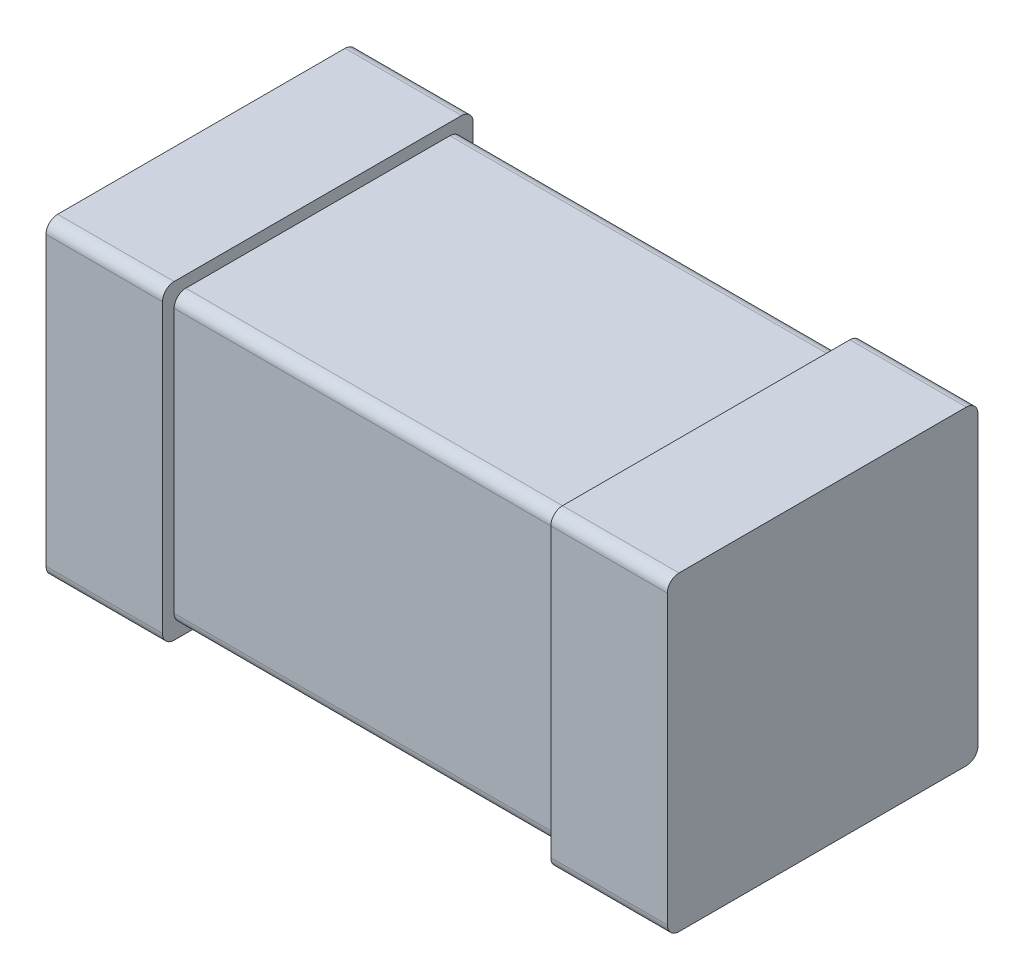
ISO-10303-21;
HEADER;
FILE_DESCRIPTION(('STEP AP214'),'2;1');
FILE_NAME('part.step','',(''),(''),'','','');
FILE_SCHEMA(('AUTOMOTIVE_DESIGN { 1 0 10303 214 1 1 1 1 }'));
ENDSEC;
DATA;
#1=APPLICATION_CONTEXT('core data for automotive mechanical design processes');
#2=APPLICATION_PROTOCOL_DEFINITION('international standard','automotive_design',2000,#1);
#3=PRODUCT_CONTEXT('',#1,'mechanical');
#4=PRODUCT('Part','Part','',(#3));
#5=PRODUCT_RELATED_PRODUCT_CATEGORY('part','',(#4));
#6=PRODUCT_DEFINITION_FORMATION('','',#4);
#7=PRODUCT_DEFINITION_CONTEXT('part definition',#1,'design');
#8=PRODUCT_DEFINITION('design','',#6,#7);
#9=PRODUCT_DEFINITION_SHAPE('','',#8);
#10=(LENGTH_UNIT() NAMED_UNIT(*) SI_UNIT(.MILLI.,.METRE.));
#11=(NAMED_UNIT(*) PLANE_ANGLE_UNIT() SI_UNIT($,.RADIAN.));
#12=(NAMED_UNIT(*) SI_UNIT($,.STERADIAN.) SOLID_ANGLE_UNIT());
#13=UNCERTAINTY_MEASURE_WITH_UNIT(LENGTH_MEASURE(1.E-05),#10,'distance_accuracy_value','');
#14=(GEOMETRIC_REPRESENTATION_CONTEXT(3) GLOBAL_UNCERTAINTY_ASSIGNED_CONTEXT((#13)) GLOBAL_UNIT_ASSIGNED_CONTEXT((#10,
#11,#12)) REPRESENTATION_CONTEXT('',''));
#15=CARTESIAN_POINT('',(0.,0.,0.));
#16=DIRECTION('',(0.,0.,1.));
#17=DIRECTION('',(1.,0.,0.));
#18=AXIS2_PLACEMENT_3D('',#15,#16,#17);
#19=CARTESIAN_POINT('',(0.8,-0.4,0.));
#20=DIRECTION('',(1.,0.,0.));
#21=DIRECTION('',(0.,1.,0.));
#22=AXIS2_PLACEMENT_3D('',#19,#20,#21);
#23=PLANE('',#22);
#24=DIRECTION('',(0.,0.,1.));
#25=VECTOR('',#24,1.);
#26=CARTESIAN_POINT('',(0.8,-0.4,0.));
#27=LINE('',#26,#25);
#28=CARTESIAN_POINT('',(0.8,-0.4,0.03));
#29=VERTEX_POINT('',#28);
#30=CARTESIAN_POINT('',(0.8,-0.4,0.77));
#31=VERTEX_POINT('',#30);
#32=EDGE_CURVE('E230',#29,#31,#27,.T.);
#33=ORIENTED_EDGE('',*,*,#32,.F.);
#34=CARTESIAN_POINT('',(0.8,-0.37,0.03));
#35=DIRECTION('',(1.,0.,0.));
#36=DIRECTION('',(0.,0.,1.));
#37=AXIS2_PLACEMENT_3D('',#34,#35,#36);
#38=CIRCLE('',#37,0.03);
#39=CARTESIAN_POINT('',(0.8,-0.37,0.));
#40=VERTEX_POINT('',#39);
#41=EDGE_CURVE('E186',#29,#40,#38,.T.);
#42=ORIENTED_EDGE('',*,*,#41,.T.);
#43=DIRECTION('',(0.,1.,0.));
#44=VECTOR('',#43,1.);
#45=CARTESIAN_POINT('',(0.8,-0.4,0.));
#46=LINE('',#45,#44);
#47=CARTESIAN_POINT('',(0.8,0.37,0.));
#48=VERTEX_POINT('',#47);
#49=EDGE_CURVE('E184',#40,#48,#46,.T.);
#50=ORIENTED_EDGE('',*,*,#49,.T.);
#51=CARTESIAN_POINT('',(0.8,0.37,0.03));
#52=DIRECTION('',(-1.,0.,0.));
#53=DIRECTION('',(0.,0.,1.));
#54=AXIS2_PLACEMENT_3D('',#51,#52,#53);
#55=CIRCLE('',#54,0.03);
#56=CARTESIAN_POINT('',(0.8,0.4,0.03));
#57=VERTEX_POINT('',#56);
#58=EDGE_CURVE('E172',#57,#48,#55,.T.);
#59=ORIENTED_EDGE('',*,*,#58,.F.);
#60=DIRECTION('',(0.,0.,1.));
#61=VECTOR('',#60,1.);
#62=CARTESIAN_POINT('',(0.8,0.4,0.));
#63=LINE('',#62,#61);
#64=CARTESIAN_POINT('',(0.8,0.4,0.77));
#65=VERTEX_POINT('',#64);
#66=EDGE_CURVE('E11',#57,#65,#63,.T.);
#67=ORIENTED_EDGE('',*,*,#66,.T.);
#68=CARTESIAN_POINT('',(0.8,0.37,0.77));
#69=DIRECTION('',(1.,0.,0.));
#70=DIRECTION('',(0.,0.,1.));
#71=AXIS2_PLACEMENT_3D('',#68,#69,#70);
#72=CIRCLE('',#71,0.03);
#73=CARTESIAN_POINT('',(0.8,0.37,0.8));
#74=VERTEX_POINT('',#73);
#75=EDGE_CURVE('E181',#65,#74,#72,.T.);
#76=ORIENTED_EDGE('',*,*,#75,.T.);
#77=DIRECTION('',(0.,1.,0.));
#78=VECTOR('',#77,1.);
#79=CARTESIAN_POINT('',(0.8,-0.4,0.8));
#80=LINE('',#79,#78);
#81=CARTESIAN_POINT('',(0.8,-0.37,0.8));
#82=VERTEX_POINT('',#81);
#83=EDGE_CURVE('E190',#82,#74,#80,.T.);
#84=ORIENTED_EDGE('',*,*,#83,.F.);
#85=CARTESIAN_POINT('',(0.8,-0.37,0.77));
#86=DIRECTION('',(-1.,0.,0.));
#87=DIRECTION('',(0.,0.,1.));
#88=AXIS2_PLACEMENT_3D('',#85,#86,#87);
#89=CIRCLE('',#88,0.03);
#90=EDGE_CURVE('E203',#31,#82,#89,.T.);
#91=ORIENTED_EDGE('',*,*,#90,.F.);
#92=EDGE_LOOP('',(#33,#42,#50,#59,#67,#76,#84,#91));
#93=FACE_BOUND('',#92,.T.);
#94=ADVANCED_FACE('F17',(#93),#23,.T.);
#95=CARTESIAN_POINT('',(0.5,0.4,0.));
#96=DIRECTION('',(0.,1.,0.));
#97=DIRECTION('',(1.,0.,0.));
#98=AXIS2_PLACEMENT_3D('',#95,#96,#97);
#99=PLANE('',#98);
#100=ORIENTED_EDGE('',*,*,#66,.F.);
#101=DIRECTION('',(1.,0.,0.));
#102=VECTOR('',#101,1.);
#103=CARTESIAN_POINT('',(0.5,0.4,0.03));
#104=LINE('',#103,#102);
#105=CARTESIAN_POINT('',(0.5,0.4,0.03));
#106=VERTEX_POINT('',#105);
#107=EDGE_CURVE('E179',#106,#57,#104,.T.);
#108=ORIENTED_EDGE('',*,*,#107,.F.);
#109=DIRECTION('',(0.,0.,1.));
#110=VECTOR('',#109,1.);
#111=CARTESIAN_POINT('',(0.5,0.4,0.));
#112=LINE('',#111,#110);
#113=CARTESIAN_POINT('',(0.5,0.4,0.77));
#114=VERTEX_POINT('',#113);
#115=EDGE_CURVE('E257',#106,#114,#112,.T.);
#116=ORIENTED_EDGE('',*,*,#115,.T.);
#117=DIRECTION('',(1.,0.,0.));
#118=VECTOR('',#117,1.);
#119=CARTESIAN_POINT('',(0.5,0.4,0.77));
#120=LINE('',#119,#118);
#121=EDGE_CURVE('E26',#114,#65,#120,.T.);
#122=ORIENTED_EDGE('',*,*,#121,.T.);
#123=EDGE_LOOP('',(#100,#108,#116,#122));
#124=FACE_BOUND('',#123,.T.);
#125=ADVANCED_FACE('F559',(#124),#99,.T.);
#126=CARTESIAN_POINT('',(0.5,0.37,0.77));
#127=DIRECTION('',(1.,0.,0.));
#128=DIRECTION('',(0.,1.,0.));
#129=AXIS2_PLACEMENT_3D('',#126,#127,#128);
#130=CYLINDRICAL_SURFACE('',#129,0.03);
#131=CARTESIAN_POINT('',(0.5,0.37,0.77));
#132=DIRECTION('',(1.,0.,0.));
#133=DIRECTION('',(0.,0.,1.));
#134=AXIS2_PLACEMENT_3D('',#131,#132,#133);
#135=CIRCLE('',#134,0.03);
#136=CARTESIAN_POINT('',(0.5,0.37,0.8));
#137=VERTEX_POINT('',#136);
#138=EDGE_CURVE('E258',#114,#137,#135,.T.);
#139=ORIENTED_EDGE('',*,*,#138,.T.);
#140=DIRECTION('',(1.,0.,0.));
#141=VECTOR('',#140,1.);
#142=CARTESIAN_POINT('',(0.5,0.37,0.8));
#143=LINE('',#142,#141);
#144=EDGE_CURVE('E206',#137,#74,#143,.T.);
#145=ORIENTED_EDGE('',*,*,#144,.T.);
#146=ORIENTED_EDGE('',*,*,#75,.F.);
#147=ORIENTED_EDGE('',*,*,#121,.F.);
#148=EDGE_LOOP('',(#139,#145,#146,#147));
#149=FACE_BOUND('',#148,.T.);
#150=ADVANCED_FACE('F19',(#149),#130,.T.);
#151=CARTESIAN_POINT('',(0.5,0.37,0.03));
#152=DIRECTION('',(1.,0.,0.));
#153=DIRECTION('',(0.,1.,0.));
#154=AXIS2_PLACEMENT_3D('',#151,#152,#153);
#155=CYLINDRICAL_SURFACE('',#154,0.03);
#156=ORIENTED_EDGE('',*,*,#107,.T.);
#157=ORIENTED_EDGE('',*,*,#58,.T.);
#158=DIRECTION('',(1.,0.,0.));
#159=VECTOR('',#158,1.);
#160=CARTESIAN_POINT('',(0.5,0.37,0.));
#161=LINE('',#160,#159);
#162=CARTESIAN_POINT('',(0.5,0.37,0.));
#163=VERTEX_POINT('',#162);
#164=EDGE_CURVE('E177',#163,#48,#161,.T.);
#165=ORIENTED_EDGE('',*,*,#164,.F.);
#166=CARTESIAN_POINT('',(0.5,0.37,0.03));
#167=DIRECTION('',(-1.,0.,0.));
#168=DIRECTION('',(0.,0.,1.));
#169=AXIS2_PLACEMENT_3D('',#166,#167,#168);
#170=CIRCLE('',#169,0.03);
#171=EDGE_CURVE('E254',#106,#163,#170,.T.);
#172=ORIENTED_EDGE('',*,*,#171,.F.);
#173=EDGE_LOOP('',(#156,#157,#165,#172));
#174=FACE_BOUND('',#173,.T.);
#175=ADVANCED_FACE('F174',(#174),#155,.T.);
#176=CARTESIAN_POINT('',(0.5,-0.4,0.8));
#177=DIRECTION('',(0.,0.,1.));
#178=DIRECTION('',(1.,0.,0.));
#179=AXIS2_PLACEMENT_3D('',#176,#177,#178);
#180=PLANE('',#179);
#181=DIRECTION('',(0.,1.,0.));
#182=VECTOR('',#181,1.);
#183=CARTESIAN_POINT('',(0.5,-0.4,0.8));
#184=LINE('',#183,#182);
#185=CARTESIAN_POINT('',(0.5,-0.37,0.8));
#186=VERTEX_POINT('',#185);
#187=EDGE_CURVE('E262',#186,#137,#184,.T.);
#188=ORIENTED_EDGE('',*,*,#187,.F.);
#189=DIRECTION('',(1.,0.,0.));
#190=VECTOR('',#189,1.);
#191=CARTESIAN_POINT('',(0.5,-0.37,0.8));
#192=LINE('',#191,#190);
#193=EDGE_CURVE('E197',#186,#82,#192,.T.);
#194=ORIENTED_EDGE('',*,*,#193,.T.);
#195=ORIENTED_EDGE('',*,*,#83,.T.);
#196=ORIENTED_EDGE('',*,*,#144,.F.);
#197=EDGE_LOOP('',(#188,#194,#195,#196));
#198=FACE_BOUND('',#197,.T.);
#199=ADVANCED_FACE('F571',(#198),#180,.T.);
#200=CARTESIAN_POINT('',(0.5,-0.4,0.));
#201=DIRECTION('',(0.,0.,1.));
#202=DIRECTION('',(1.,0.,0.));
#203=AXIS2_PLACEMENT_3D('',#200,#201,#202);
#204=PLANE('',#203);
#205=ORIENTED_EDGE('',*,*,#164,.T.);
#206=ORIENTED_EDGE('',*,*,#49,.F.);
#207=DIRECTION('',(1.,0.,0.));
#208=VECTOR('',#207,1.);
#209=CARTESIAN_POINT('',(0.5,-0.37,0.));
#210=LINE('',#209,#208);
#211=CARTESIAN_POINT('',(0.5,-0.37,0.));
#212=VERTEX_POINT('',#211);
#213=EDGE_CURVE('E224',#212,#40,#210,.T.);
#214=ORIENTED_EDGE('',*,*,#213,.F.);
#215=DIRECTION('',(0.,1.,0.));
#216=VECTOR('',#215,1.);
#217=CARTESIAN_POINT('',(0.5,-0.4,0.));
#218=LINE('',#217,#216);
#219=EDGE_CURVE('E194',#212,#163,#218,.T.);
#220=ORIENTED_EDGE('',*,*,#219,.T.);
#221=EDGE_LOOP('',(#205,#206,#214,#220));
#222=FACE_BOUND('',#221,.T.);
#223=ADVANCED_FACE('F192',(#222),#204,.F.);
#224=CARTESIAN_POINT('',(0.5,-0.37,0.77));
#225=DIRECTION('',(1.,0.,0.));
#226=DIRECTION('',(0.,-1.,0.));
#227=AXIS2_PLACEMENT_3D('',#224,#225,#226);
#228=CYLINDRICAL_SURFACE('',#227,0.03);
#229=DIRECTION('',(1.,0.,0.));
#230=VECTOR('',#229,1.);
#231=CARTESIAN_POINT('',(0.5,-0.4,0.77));
#232=LINE('',#231,#230);
#233=CARTESIAN_POINT('',(0.5,-0.4,0.77));
#234=VERTEX_POINT('',#233);
#235=EDGE_CURVE('E244',#234,#31,#232,.T.);
#236=ORIENTED_EDGE('',*,*,#235,.T.);
#237=ORIENTED_EDGE('',*,*,#90,.T.);
#238=ORIENTED_EDGE('',*,*,#193,.F.);
#239=CARTESIAN_POINT('',(0.5,-0.37,0.77));
#240=DIRECTION('',(-1.,0.,0.));
#241=DIRECTION('',(0.,0.,1.));
#242=AXIS2_PLACEMENT_3D('',#239,#240,#241);
#243=CIRCLE('',#242,0.03);
#244=EDGE_CURVE('E266',#234,#186,#243,.T.);
#245=ORIENTED_EDGE('',*,*,#244,.F.);
#246=EDGE_LOOP('',(#236,#237,#238,#245));
#247=FACE_BOUND('',#246,.T.);
#248=ADVANCED_FACE('F567',(#247),#228,.T.);
#249=CARTESIAN_POINT('',(0.5,-0.37,0.03));
#250=DIRECTION('',(1.,0.,0.));
#251=DIRECTION('',(0.,-1.,0.));
#252=AXIS2_PLACEMENT_3D('',#249,#250,#251);
#253=CYLINDRICAL_SURFACE('',#252,0.03);
#254=CARTESIAN_POINT('',(0.5,-0.37,0.03));
#255=DIRECTION('',(1.,0.,0.));
#256=DIRECTION('',(0.,0.,1.));
#257=AXIS2_PLACEMENT_3D('',#254,#255,#256);
#258=CIRCLE('',#257,0.03);
#259=CARTESIAN_POINT('',(0.5,-0.4,0.03));
#260=VERTEX_POINT('',#259);
#261=EDGE_CURVE('E249',#260,#212,#258,.T.);
#262=ORIENTED_EDGE('',*,*,#261,.T.);
#263=ORIENTED_EDGE('',*,*,#213,.T.);
#264=ORIENTED_EDGE('',*,*,#41,.F.);
#265=DIRECTION('',(1.,0.,0.));
#266=VECTOR('',#265,1.);
#267=CARTESIAN_POINT('',(0.5,-0.4,0.03));
#268=LINE('',#267,#266);
#269=EDGE_CURVE('E237',#260,#29,#268,.T.);
#270=ORIENTED_EDGE('',*,*,#269,.F.);
#271=EDGE_LOOP('',(#262,#263,#264,#270));
#272=FACE_BOUND('',#271,.T.);
#273=ADVANCED_FACE('F595',(#272),#253,.T.);
#274=CARTESIAN_POINT('',(0.5,-0.4,0.));
#275=DIRECTION('',(0.,1.,0.));
#276=DIRECTION('',(1.,0.,0.));
#277=AXIS2_PLACEMENT_3D('',#274,#275,#276);
#278=PLANE('',#277);
#279=ORIENTED_EDGE('',*,*,#235,.F.);
#280=DIRECTION('',(0.,0.,1.));
#281=VECTOR('',#280,1.);
#282=CARTESIAN_POINT('',(0.5,-0.4,0.));
#283=LINE('',#282,#281);
#284=EDGE_CURVE('E246',#260,#234,#283,.T.);
#285=ORIENTED_EDGE('',*,*,#284,.F.);
#286=ORIENTED_EDGE('',*,*,#269,.T.);
#287=ORIENTED_EDGE('',*,*,#32,.T.);
#288=EDGE_LOOP('',(#279,#285,#286,#287));
#289=FACE_BOUND('',#288,.T.);
#290=ADVANCED_FACE('F593',(#289),#278,.F.);
#291=CARTESIAN_POINT('',(0.5,-0.4,0.));
#292=DIRECTION('',(1.,0.,0.));
#293=DIRECTION('',(0.,1.,0.));
#294=AXIS2_PLACEMENT_3D('',#291,#292,#293);
#295=PLANE('',#294);
#296=DIRECTION('',(0.,1.,0.));
#297=VECTOR('',#296,1.);
#298=CARTESIAN_POINT('',(0.5,-0.37,0.03));
#299=LINE('',#298,#297);
#300=CARTESIAN_POINT('',(0.5,-0.34,0.03));
#301=VERTEX_POINT('',#300);
#302=CARTESIAN_POINT('',(0.5,0.34,0.03));
#303=VERTEX_POINT('',#302);
#304=EDGE_CURVE('E306',#301,#303,#299,.T.);
#305=ORIENTED_EDGE('',*,*,#304,.T.);
#306=CARTESIAN_POINT('',(0.5,0.34,0.06));
#307=DIRECTION('',(-1.,0.,0.));
#308=DIRECTION('',(0.,0.,1.));
#309=AXIS2_PLACEMENT_3D('',#306,#307,#308);
#310=CIRCLE('',#309,0.03);
#311=CARTESIAN_POINT('',(0.5,0.37,0.06));
#312=VERTEX_POINT('',#311);
#313=EDGE_CURVE('E300',#312,#303,#310,.T.);
#314=ORIENTED_EDGE('',*,*,#313,.F.);
#315=DIRECTION('',(0.,0.,1.));
#316=VECTOR('',#315,1.);
#317=CARTESIAN_POINT('',(0.5,0.37,0.03));
#318=LINE('',#317,#316);
#319=CARTESIAN_POINT('',(0.5,0.37,0.74));
#320=VERTEX_POINT('',#319);
#321=EDGE_CURVE('E296',#312,#320,#318,.T.);
#322=ORIENTED_EDGE('',*,*,#321,.T.);
#323=CARTESIAN_POINT('',(0.5,0.34,0.74));
#324=DIRECTION('',(1.,0.,0.));
#325=DIRECTION('',(0.,0.,1.));
#326=AXIS2_PLACEMENT_3D('',#323,#324,#325);
#327=CIRCLE('',#326,0.03);
#328=CARTESIAN_POINT('',(0.5,0.34,0.77));
#329=VERTEX_POINT('',#328);
#330=EDGE_CURVE('E284',#320,#329,#327,.T.);
#331=ORIENTED_EDGE('',*,*,#330,.T.);
#332=DIRECTION('',(0.,1.,0.));
#333=VECTOR('',#332,1.);
#334=CARTESIAN_POINT('',(0.5,-0.37,0.77));
#335=LINE('',#334,#333);
#336=CARTESIAN_POINT('',(0.5,-0.34,0.77));
#337=VERTEX_POINT('',#336);
#338=EDGE_CURVE('E275',#337,#329,#335,.T.);
#339=ORIENTED_EDGE('',*,*,#338,.F.);
#340=CARTESIAN_POINT('',(0.5,-0.34,0.74));
#341=DIRECTION('',(-1.,0.,0.));
#342=DIRECTION('',(0.,0.,1.));
#343=AXIS2_PLACEMENT_3D('',#340,#341,#342);
#344=CIRCLE('',#343,0.03);
#345=CARTESIAN_POINT('',(0.5,-0.37,0.74));
#346=VERTEX_POINT('',#345);
#347=EDGE_CURVE('E267',#346,#337,#344,.T.);
#348=ORIENTED_EDGE('',*,*,#347,.F.);
#349=DIRECTION('',(0.,0.,1.));
#350=VECTOR('',#349,1.);
#351=CARTESIAN_POINT('',(0.5,-0.37,0.03));
#352=LINE('',#351,#350);
#353=CARTESIAN_POINT('',(0.5,-0.37,0.06));
#354=VERTEX_POINT('',#353);
#355=EDGE_CURVE('E270',#354,#346,#352,.T.);
#356=ORIENTED_EDGE('',*,*,#355,.F.);
#357=CARTESIAN_POINT('',(0.5,-0.34,0.06));
#358=DIRECTION('',(1.,0.,0.));
#359=DIRECTION('',(0.,0.,1.));
#360=AXIS2_PLACEMENT_3D('',#357,#358,#359);
#361=CIRCLE('',#360,0.03);
#362=EDGE_CURVE('E315',#354,#301,#361,.T.);
#363=ORIENTED_EDGE('',*,*,#362,.T.);
#364=EDGE_LOOP('',(#305,#314,#322,#331,#339,#348,#356,#363));
#365=FACE_BOUND('',#364,.T.);
#366=ORIENTED_EDGE('',*,*,#244,.T.);
#367=ORIENTED_EDGE('',*,*,#187,.T.);
#368=ORIENTED_EDGE('',*,*,#138,.F.);
#369=ORIENTED_EDGE('',*,*,#115,.F.);
#370=ORIENTED_EDGE('',*,*,#171,.T.);
#371=ORIENTED_EDGE('',*,*,#219,.F.);
#372=ORIENTED_EDGE('',*,*,#261,.F.);
#373=ORIENTED_EDGE('',*,*,#284,.T.);
#374=EDGE_LOOP('',(#366,#367,#368,#369,#370,#371,#372,#373));
#375=FACE_BOUND('',#374,.T.);
#376=ADVANCED_FACE('F585',(#365,#375),#295,.F.);
#377=CARTESIAN_POINT('',(-0.5,-0.37,0.03));
#378=DIRECTION('',(0.,1.,0.));
#379=DIRECTION('',(1.,0.,0.));
#380=AXIS2_PLACEMENT_3D('',#377,#378,#379);
#381=PLANE('',#380);
#382=DIRECTION('',(1.,0.,0.));
#383=VECTOR('',#382,1.);
#384=CARTESIAN_POINT('',(-0.5,-0.37,0.74));
#385=LINE('',#384,#383);
#386=CARTESIAN_POINT('',(-0.5,-0.37,0.74));
#387=VERTEX_POINT('',#386);
#388=EDGE_CURVE('E271',#387,#346,#385,.T.);
#389=ORIENTED_EDGE('',*,*,#388,.F.);
#390=DIRECTION('',(0.,0.,1.));
#391=VECTOR('',#390,1.);
#392=CARTESIAN_POINT('',(-0.5,-0.37,0.03));
#393=LINE('',#392,#391);
#394=CARTESIAN_POINT('',(-0.5,-0.37,0.06));
#395=VERTEX_POINT('',#394);
#396=EDGE_CURVE('E347',#395,#387,#393,.T.);
#397=ORIENTED_EDGE('',*,*,#396,.F.);
#398=DIRECTION('',(1.,0.,0.));
#399=VECTOR('',#398,1.);
#400=CARTESIAN_POINT('',(-0.5,-0.37,0.06));
#401=LINE('',#400,#399);
#402=EDGE_CURVE('E311',#395,#354,#401,.T.);
#403=ORIENTED_EDGE('',*,*,#402,.T.);
#404=ORIENTED_EDGE('',*,*,#355,.T.);
#405=EDGE_LOOP('',(#389,#397,#403,#404));
#406=FACE_BOUND('',#405,.T.);
#407=ADVANCED_FACE('F605',(#406),#381,.F.);
#408=CARTESIAN_POINT('',(-0.5,-0.34,0.74));
#409=DIRECTION('',(1.,0.,0.));
#410=DIRECTION('',(0.,-1.,0.));
#411=AXIS2_PLACEMENT_3D('',#408,#409,#410);
#412=CYLINDRICAL_SURFACE('',#411,0.03);
#413=ORIENTED_EDGE('',*,*,#388,.T.);
#414=ORIENTED_EDGE('',*,*,#347,.T.);
#415=DIRECTION('',(1.,0.,0.));
#416=VECTOR('',#415,1.);
#417=CARTESIAN_POINT('',(-0.5,-0.34,0.77));
#418=LINE('',#417,#416);
#419=CARTESIAN_POINT('',(-0.5,-0.34,0.77));
#420=VERTEX_POINT('',#419);
#421=EDGE_CURVE('E278',#420,#337,#418,.T.);
#422=ORIENTED_EDGE('',*,*,#421,.F.);
#423=CARTESIAN_POINT('',(-0.5,-0.34,0.74));
#424=DIRECTION('',(-1.,0.,0.));
#425=DIRECTION('',(0.,0.,1.));
#426=AXIS2_PLACEMENT_3D('',#423,#424,#425);
#427=CIRCLE('',#426,0.03);
#428=EDGE_CURVE('E343',#387,#420,#427,.T.);
#429=ORIENTED_EDGE('',*,*,#428,.F.);
#430=EDGE_LOOP('',(#413,#414,#422,#429));
#431=FACE_BOUND('',#430,.T.);
#432=ADVANCED_FACE('F619',(#431),#412,.T.);
#433=CARTESIAN_POINT('',(-0.5,-0.37,0.77));
#434=DIRECTION('',(0.,0.,1.));
#435=DIRECTION('',(1.,0.,0.));
#436=AXIS2_PLACEMENT_3D('',#433,#434,#435);
#437=PLANE('',#436);
#438=DIRECTION('',(0.,1.,0.));
#439=VECTOR('',#438,1.);
#440=CARTESIAN_POINT('',(-0.5,-0.37,0.77));
#441=LINE('',#440,#439);
#442=CARTESIAN_POINT('',(-0.5,0.34,0.77));
#443=VERTEX_POINT('',#442);
#444=EDGE_CURVE('E339',#420,#443,#441,.T.);
#445=ORIENTED_EDGE('',*,*,#444,.F.);
#446=ORIENTED_EDGE('',*,*,#421,.T.);
#447=ORIENTED_EDGE('',*,*,#338,.T.);
#448=DIRECTION('',(1.,0.,0.));
#449=VECTOR('',#448,1.);
#450=CARTESIAN_POINT('',(-0.5,0.34,0.77));
#451=LINE('',#450,#449);
#452=EDGE_CURVE('E285',#443,#329,#451,.T.);
#453=ORIENTED_EDGE('',*,*,#452,.F.);
#454=EDGE_LOOP('',(#445,#446,#447,#453));
#455=FACE_BOUND('',#454,.T.);
#456=ADVANCED_FACE('F611',(#455),#437,.T.);
#457=CARTESIAN_POINT('',(-0.5,0.34,0.74));
#458=DIRECTION('',(1.,0.,0.));
#459=DIRECTION('',(0.,1.,0.));
#460=AXIS2_PLACEMENT_3D('',#457,#458,#459);
#461=CYLINDRICAL_SURFACE('',#460,0.03);
#462=CARTESIAN_POINT('',(-0.5,0.34,0.74));
#463=DIRECTION('',(1.,0.,0.));
#464=DIRECTION('',(0.,0.,1.));
#465=AXIS2_PLACEMENT_3D('',#462,#463,#464);
#466=CIRCLE('',#465,0.03);
#467=CARTESIAN_POINT('',(-0.5,0.37,0.74));
#468=VERTEX_POINT('',#467);
#469=EDGE_CURVE('E335',#468,#443,#466,.T.);
#470=ORIENTED_EDGE('',*,*,#469,.T.);
#471=ORIENTED_EDGE('',*,*,#452,.T.);
#472=ORIENTED_EDGE('',*,*,#330,.F.);
#473=DIRECTION('',(1.,0.,0.));
#474=VECTOR('',#473,1.);
#475=CARTESIAN_POINT('',(-0.5,0.37,0.74));
#476=LINE('',#475,#474);
#477=EDGE_CURVE('E289',#468,#320,#476,.T.);
#478=ORIENTED_EDGE('',*,*,#477,.F.);
#479=EDGE_LOOP('',(#470,#471,#472,#478));
#480=FACE_BOUND('',#479,.T.);
#481=ADVANCED_FACE('F607',(#480),#461,.T.);
#482=CARTESIAN_POINT('',(-0.5,0.37,0.03));
#483=DIRECTION('',(0.,1.,0.));
#484=DIRECTION('',(1.,0.,0.));
#485=AXIS2_PLACEMENT_3D('',#482,#483,#484);
#486=PLANE('',#485);
#487=ORIENTED_EDGE('',*,*,#321,.F.);
#488=DIRECTION('',(1.,0.,0.));
#489=VECTOR('',#488,1.);
#490=CARTESIAN_POINT('',(-0.5,0.37,0.06));
#491=LINE('',#490,#489);
#492=CARTESIAN_POINT('',(-0.5,0.37,0.06));
#493=VERTEX_POINT('',#492);
#494=EDGE_CURVE('E305',#493,#312,#491,.T.);
#495=ORIENTED_EDGE('',*,*,#494,.F.);
#496=DIRECTION('',(0.,0.,1.));
#497=VECTOR('',#496,1.);
#498=CARTESIAN_POINT('',(-0.5,0.37,0.03));
#499=LINE('',#498,#497);
#500=EDGE_CURVE('E334',#493,#468,#499,.T.);
#501=ORIENTED_EDGE('',*,*,#500,.T.);
#502=ORIENTED_EDGE('',*,*,#477,.T.);
#503=EDGE_LOOP('',(#487,#495,#501,#502));
#504=FACE_BOUND('',#503,.T.);
#505=ADVANCED_FACE('F610',(#504),#486,.T.);
#506=CARTESIAN_POINT('',(-0.5,0.34,0.06));
#507=DIRECTION('',(1.,0.,0.));
#508=DIRECTION('',(0.,1.,0.));
#509=AXIS2_PLACEMENT_3D('',#506,#507,#508);
#510=CYLINDRICAL_SURFACE('',#509,0.03);
#511=ORIENTED_EDGE('',*,*,#494,.T.);
#512=ORIENTED_EDGE('',*,*,#313,.T.);
#513=DIRECTION('',(1.,0.,0.));
#514=VECTOR('',#513,1.);
#515=CARTESIAN_POINT('',(-0.5,0.34,0.03));
#516=LINE('',#515,#514);
#517=CARTESIAN_POINT('',(-0.5,0.34,0.03));
#518=VERTEX_POINT('',#517);
#519=EDGE_CURVE('E310',#518,#303,#516,.T.);
#520=ORIENTED_EDGE('',*,*,#519,.F.);
#521=CARTESIAN_POINT('',(-0.5,0.34,0.06));
#522=DIRECTION('',(-1.,0.,0.));
#523=DIRECTION('',(0.,0.,1.));
#524=AXIS2_PLACEMENT_3D('',#521,#522,#523);
#525=CIRCLE('',#524,0.03);
#526=EDGE_CURVE('E327',#493,#518,#525,.T.);
#527=ORIENTED_EDGE('',*,*,#526,.F.);
#528=EDGE_LOOP('',(#511,#512,#520,#527));
#529=FACE_BOUND('',#528,.T.);
#530=ADVANCED_FACE('F615',(#529),#510,.T.);
#531=CARTESIAN_POINT('',(-0.5,-0.37,0.03));
#532=DIRECTION('',(0.,0.,1.));
#533=DIRECTION('',(1.,0.,0.));
#534=AXIS2_PLACEMENT_3D('',#531,#532,#533);
#535=PLANE('',#534);
#536=ORIENTED_EDGE('',*,*,#519,.T.);
#537=ORIENTED_EDGE('',*,*,#304,.F.);
#538=DIRECTION('',(1.,0.,0.));
#539=VECTOR('',#538,1.);
#540=CARTESIAN_POINT('',(-0.5,-0.34,0.03));
#541=LINE('',#540,#539);
#542=CARTESIAN_POINT('',(-0.5,-0.34,0.03));
#543=VERTEX_POINT('',#542);
#544=EDGE_CURVE('E319',#543,#301,#541,.T.);
#545=ORIENTED_EDGE('',*,*,#544,.F.);
#546=DIRECTION('',(0.,1.,0.));
#547=VECTOR('',#546,1.);
#548=CARTESIAN_POINT('',(-0.5,-0.37,0.03));
#549=LINE('',#548,#547);
#550=EDGE_CURVE('E323',#543,#518,#549,.T.);
#551=ORIENTED_EDGE('',*,*,#550,.T.);
#552=EDGE_LOOP('',(#536,#537,#545,#551));
#553=FACE_BOUND('',#552,.T.);
#554=ADVANCED_FACE('F621',(#553),#535,.F.);
#555=CARTESIAN_POINT('',(-0.5,-0.34,0.06));
#556=DIRECTION('',(1.,0.,0.));
#557=DIRECTION('',(0.,-1.,0.));
#558=AXIS2_PLACEMENT_3D('',#555,#556,#557);
#559=CYLINDRICAL_SURFACE('',#558,0.03);
#560=CARTESIAN_POINT('',(-0.5,-0.34,0.06));
#561=DIRECTION('',(1.,0.,0.));
#562=DIRECTION('',(0.,0.,1.));
#563=AXIS2_PLACEMENT_3D('',#560,#561,#562);
#564=CIRCLE('',#563,0.03);
#565=EDGE_CURVE('E351',#395,#543,#564,.T.);
#566=ORIENTED_EDGE('',*,*,#565,.T.);
#567=ORIENTED_EDGE('',*,*,#544,.T.);
#568=ORIENTED_EDGE('',*,*,#362,.F.);
#569=ORIENTED_EDGE('',*,*,#402,.F.);
#570=EDGE_LOOP('',(#566,#567,#568,#569));
#571=FACE_BOUND('',#570,.T.);
#572=ADVANCED_FACE('F624',(#571),#559,.T.);
#573=CARTESIAN_POINT('',(-0.5,-0.4,0.));
#574=DIRECTION('',(1.,0.,0.));
#575=DIRECTION('',(0.,1.,0.));
#576=AXIS2_PLACEMENT_3D('',#573,#574,#575);
#577=PLANE('',#576);
#578=ORIENTED_EDGE('',*,*,#565,.F.);
#579=ORIENTED_EDGE('',*,*,#396,.T.);
#580=ORIENTED_EDGE('',*,*,#428,.T.);
#581=ORIENTED_EDGE('',*,*,#444,.T.);
#582=ORIENTED_EDGE('',*,*,#469,.F.);
#583=ORIENTED_EDGE('',*,*,#500,.F.);
#584=ORIENTED_EDGE('',*,*,#526,.T.);
#585=ORIENTED_EDGE('',*,*,#550,.F.);
#586=EDGE_LOOP('',(#578,#579,#580,#581,#582,#583,#584,#585));
#587=FACE_BOUND('',#586,.T.);
#588=DIRECTION('',(0.,0.,1.));
#589=VECTOR('',#588,1.);
#590=CARTESIAN_POINT('',(-0.5,-0.4,0.));
#591=LINE('',#590,#589);
#592=CARTESIAN_POINT('',(-0.5,-0.4,0.03));
#593=VERTEX_POINT('',#592);
#594=CARTESIAN_POINT('',(-0.5,-0.4,0.77));
#595=VERTEX_POINT('',#594);
#596=EDGE_CURVE('E402',#593,#595,#591,.T.);
#597=ORIENTED_EDGE('',*,*,#596,.F.);
#598=CARTESIAN_POINT('',(-0.5,-0.37,0.03));
#599=DIRECTION('',(1.,0.,0.));
#600=DIRECTION('',(0.,0.,1.));
#601=AXIS2_PLACEMENT_3D('',#598,#599,#600);
#602=CIRCLE('',#601,0.03);
#603=CARTESIAN_POINT('',(-0.5,-0.37,0.));
#604=VERTEX_POINT('',#603);
#605=EDGE_CURVE('E401',#593,#604,#602,.T.);
#606=ORIENTED_EDGE('',*,*,#605,.T.);
#607=DIRECTION('',(0.,1.,0.));
#608=VECTOR('',#607,1.);
#609=CARTESIAN_POINT('',(-0.5,-0.4,0.));
#610=LINE('',#609,#608);
#611=CARTESIAN_POINT('',(-0.5,0.37,0.));
#612=VERTEX_POINT('',#611);
#613=EDGE_CURVE('E388',#604,#612,#610,.T.);
#614=ORIENTED_EDGE('',*,*,#613,.T.);
#615=CARTESIAN_POINT('',(-0.5,0.37,0.03));
#616=DIRECTION('',(-1.,0.,0.));
#617=DIRECTION('',(0.,0.,1.));
#618=AXIS2_PLACEMENT_3D('',#615,#616,#617);
#619=CIRCLE('',#618,0.03);
#620=CARTESIAN_POINT('',(-0.5,0.4,0.03));
#621=VERTEX_POINT('',#620);
#622=EDGE_CURVE('E367',#621,#612,#619,.T.);
#623=ORIENTED_EDGE('',*,*,#622,.F.);
#624=DIRECTION('',(0.,0.,1.));
#625=VECTOR('',#624,1.);
#626=CARTESIAN_POINT('',(-0.5,0.4,0.));
#627=LINE('',#626,#625);
#628=CARTESIAN_POINT('',(-0.5,0.4,0.77));
#629=VERTEX_POINT('',#628);
#630=EDGE_CURVE('E355',#621,#629,#627,.T.);
#631=ORIENTED_EDGE('',*,*,#630,.T.);
#632=CARTESIAN_POINT('',(-0.5,0.37,0.77));
#633=DIRECTION('',(1.,0.,0.));
#634=DIRECTION('',(0.,0.,1.));
#635=AXIS2_PLACEMENT_3D('',#632,#633,#634);
#636=CIRCLE('',#635,0.03);
#637=CARTESIAN_POINT('',(-0.5,0.37,0.8));
#638=VERTEX_POINT('',#637);
#639=EDGE_CURVE('E363',#629,#638,#636,.T.);
#640=ORIENTED_EDGE('',*,*,#639,.T.);
#641=DIRECTION('',(0.,1.,0.));
#642=VECTOR('',#641,1.);
#643=CARTESIAN_POINT('',(-0.5,-0.4,0.8));
#644=LINE('',#643,#642);
#645=CARTESIAN_POINT('',(-0.5,-0.37,0.8));
#646=VERTEX_POINT('',#645);
#647=EDGE_CURVE('E384',#646,#638,#644,.T.);
#648=ORIENTED_EDGE('',*,*,#647,.F.);
#649=CARTESIAN_POINT('',(-0.5,-0.37,0.77));
#650=DIRECTION('',(-1.,0.,0.));
#651=DIRECTION('',(0.,0.,1.));
#652=AXIS2_PLACEMENT_3D('',#649,#650,#651);
#653=CIRCLE('',#652,0.03);
#654=EDGE_CURVE('E396',#595,#646,#653,.T.);
#655=ORIENTED_EDGE('',*,*,#654,.F.);
#656=EDGE_LOOP('',(#597,#606,#614,#623,#631,#640,#648,#655));
#657=FACE_BOUND('',#656,.T.);
#658=ADVANCED_FACE('F530',(#587,#657),#577,.T.);
#659=CARTESIAN_POINT('',(-0.8,0.4,0.));
#660=DIRECTION('',(0.,1.,0.));
#661=DIRECTION('',(1.,0.,0.));
#662=AXIS2_PLACEMENT_3D('',#659,#660,#661);
#663=PLANE('',#662);
#664=ORIENTED_EDGE('',*,*,#630,.F.);
#665=DIRECTION('',(1.,0.,0.));
#666=VECTOR('',#665,1.);
#667=CARTESIAN_POINT('',(-0.8,0.4,0.03));
#668=LINE('',#667,#666);
#669=CARTESIAN_POINT('',(-0.8,0.4,0.03));
#670=VERTEX_POINT('',#669);
#671=EDGE_CURVE('E376',#670,#621,#668,.T.);
#672=ORIENTED_EDGE('',*,*,#671,.F.);
#673=DIRECTION('',(0.,0.,1.));
#674=VECTOR('',#673,1.);
#675=CARTESIAN_POINT('',(-0.8,0.4,0.));
#676=LINE('',#675,#674);
#677=CARTESIAN_POINT('',(-0.8,0.4,0.77));
#678=VERTEX_POINT('',#677);
#679=EDGE_CURVE('E437',#670,#678,#676,.T.);
#680=ORIENTED_EDGE('',*,*,#679,.T.);
#681=DIRECTION('',(1.,0.,0.));
#682=VECTOR('',#681,1.);
#683=CARTESIAN_POINT('',(-0.8,0.4,0.77));
#684=LINE('',#683,#682);
#685=EDGE_CURVE('E359',#678,#629,#684,.T.);
#686=ORIENTED_EDGE('',*,*,#685,.T.);
#687=EDGE_LOOP('',(#664,#672,#680,#686));
#688=FACE_BOUND('',#687,.T.);
#689=ADVANCED_FACE('F541',(#688),#663,.T.);
#690=CARTESIAN_POINT('',(-0.8,0.37,0.77));
#691=DIRECTION('',(1.,0.,0.));
#692=DIRECTION('',(0.,1.,0.));
#693=AXIS2_PLACEMENT_3D('',#690,#691,#692);
#694=CYLINDRICAL_SURFACE('',#693,0.03);
#695=CARTESIAN_POINT('',(-0.8,0.37,0.77));
#696=DIRECTION('',(1.,0.,0.));
#697=DIRECTION('',(0.,0.,1.));
#698=AXIS2_PLACEMENT_3D('',#695,#696,#697);
#699=CIRCLE('',#698,0.03);
#700=CARTESIAN_POINT('',(-0.8,0.37,0.8));
#701=VERTEX_POINT('',#700);
#702=EDGE_CURVE('E441',#678,#701,#699,.T.);
#703=ORIENTED_EDGE('',*,*,#702,.T.);
#704=DIRECTION('',(1.,0.,0.));
#705=VECTOR('',#704,1.);
#706=CARTESIAN_POINT('',(-0.8,0.37,0.8));
#707=LINE('',#706,#705);
#708=EDGE_CURVE('E380',#701,#638,#707,.T.);
#709=ORIENTED_EDGE('',*,*,#708,.T.);
#710=ORIENTED_EDGE('',*,*,#639,.F.);
#711=ORIENTED_EDGE('',*,*,#685,.F.);
#712=EDGE_LOOP('',(#703,#709,#710,#711));
#713=FACE_BOUND('',#712,.T.);
#714=ADVANCED_FACE('F544',(#713),#694,.T.);
#715=CARTESIAN_POINT('',(-0.8,0.37,0.03));
#716=DIRECTION('',(1.,0.,0.));
#717=DIRECTION('',(0.,1.,0.));
#718=AXIS2_PLACEMENT_3D('',#715,#716,#717);
#719=CYLINDRICAL_SURFACE('',#718,0.03);
#720=ORIENTED_EDGE('',*,*,#671,.T.);
#721=ORIENTED_EDGE('',*,*,#622,.T.);
#722=DIRECTION('',(1.,0.,0.));
#723=VECTOR('',#722,1.);
#724=CARTESIAN_POINT('',(-0.8,0.37,0.));
#725=LINE('',#724,#723);
#726=CARTESIAN_POINT('',(-0.8,0.37,0.));
#727=VERTEX_POINT('',#726);
#728=EDGE_CURVE('E392',#727,#612,#725,.T.);
#729=ORIENTED_EDGE('',*,*,#728,.F.);
#730=CARTESIAN_POINT('',(-0.8,0.37,0.03));
#731=DIRECTION('',(-1.,0.,0.));
#732=DIRECTION('',(0.,0.,1.));
#733=AXIS2_PLACEMENT_3D('',#730,#731,#732);
#734=CIRCLE('',#733,0.03);
#735=EDGE_CURVE('E433',#670,#727,#734,.T.);
#736=ORIENTED_EDGE('',*,*,#735,.F.);
#737=EDGE_LOOP('',(#720,#721,#729,#736));
#738=FACE_BOUND('',#737,.T.);
#739=ADVANCED_FACE('F539',(#738),#719,.T.);
#740=CARTESIAN_POINT('',(-0.8,-0.4,0.8));
#741=DIRECTION('',(0.,0.,1.));
#742=DIRECTION('',(1.,0.,0.));
#743=AXIS2_PLACEMENT_3D('',#740,#741,#742);
#744=PLANE('',#743);
#745=DIRECTION('',(0.,1.,0.));
#746=VECTOR('',#745,1.);
#747=CARTESIAN_POINT('',(-0.8,-0.4,0.8));
#748=LINE('',#747,#746);
#749=CARTESIAN_POINT('',(-0.8,-0.37,0.8));
#750=VERTEX_POINT('',#749);
#751=EDGE_CURVE('E448',#750,#701,#748,.T.);
#752=ORIENTED_EDGE('',*,*,#751,.F.);
#753=DIRECTION('',(1.,0.,0.));
#754=VECTOR('',#753,1.);
#755=CARTESIAN_POINT('',(-0.8,-0.37,0.8));
#756=LINE('',#755,#754);
#757=EDGE_CURVE('E400',#750,#646,#756,.T.);
#758=ORIENTED_EDGE('',*,*,#757,.T.);
#759=ORIENTED_EDGE('',*,*,#647,.T.);
#760=ORIENTED_EDGE('',*,*,#708,.F.);
#761=EDGE_LOOP('',(#752,#758,#759,#760));
#762=FACE_BOUND('',#761,.T.);
#763=ADVANCED_FACE('F546',(#762),#744,.T.);
#764=CARTESIAN_POINT('',(-0.8,-0.4,0.));
#765=DIRECTION('',(0.,0.,1.));
#766=DIRECTION('',(1.,0.,0.));
#767=AXIS2_PLACEMENT_3D('',#764,#765,#766);
#768=PLANE('',#767);
#769=ORIENTED_EDGE('',*,*,#728,.T.);
#770=ORIENTED_EDGE('',*,*,#613,.F.);
#771=DIRECTION('',(1.,0.,0.));
#772=VECTOR('',#771,1.);
#773=CARTESIAN_POINT('',(-0.8,-0.37,0.));
#774=LINE('',#773,#772);
#775=CARTESIAN_POINT('',(-0.8,-0.37,0.));
#776=VERTEX_POINT('',#775);
#777=EDGE_CURVE('E406',#776,#604,#774,.T.);
#778=ORIENTED_EDGE('',*,*,#777,.F.);
#779=DIRECTION('',(0.,1.,0.));
#780=VECTOR('',#779,1.);
#781=CARTESIAN_POINT('',(-0.8,-0.4,0.));
#782=LINE('',#781,#780);
#783=EDGE_CURVE('E429',#776,#727,#782,.T.);
#784=ORIENTED_EDGE('',*,*,#783,.T.);
#785=EDGE_LOOP('',(#769,#770,#778,#784));
#786=FACE_BOUND('',#785,.T.);
#787=ADVANCED_FACE('F536',(#786),#768,.F.);
#788=CARTESIAN_POINT('',(-0.8,-0.37,0.77));
#789=DIRECTION('',(1.,0.,0.));
#790=DIRECTION('',(0.,-1.,0.));
#791=AXIS2_PLACEMENT_3D('',#788,#789,#790);
#792=CYLINDRICAL_SURFACE('',#791,0.03);
#793=DIRECTION('',(1.,0.,0.));
#794=VECTOR('',#793,1.);
#795=CARTESIAN_POINT('',(-0.8,-0.4,0.77));
#796=LINE('',#795,#794);
#797=CARTESIAN_POINT('',(-0.8,-0.4,0.77));
#798=VERTEX_POINT('',#797);
#799=EDGE_CURVE('E411',#798,#595,#796,.T.);
#800=ORIENTED_EDGE('',*,*,#799,.T.);
#801=ORIENTED_EDGE('',*,*,#654,.T.);
#802=ORIENTED_EDGE('',*,*,#757,.F.);
#803=CARTESIAN_POINT('',(-0.8,-0.37,0.77));
#804=DIRECTION('',(-1.,0.,0.));
#805=DIRECTION('',(0.,0.,1.));
#806=AXIS2_PLACEMENT_3D('',#803,#804,#805);
#807=CIRCLE('',#806,0.03);
#808=EDGE_CURVE('E452',#798,#750,#807,.T.);
#809=ORIENTED_EDGE('',*,*,#808,.F.);
#810=EDGE_LOOP('',(#800,#801,#802,#809));
#811=FACE_BOUND('',#810,.T.);
#812=ADVANCED_FACE('F476',(#811),#792,.T.);
#813=CARTESIAN_POINT('',(-0.8,-0.37,0.03));
#814=DIRECTION('',(1.,0.,0.));
#815=DIRECTION('',(0.,-1.,0.));
#816=AXIS2_PLACEMENT_3D('',#813,#814,#815);
#817=CYLINDRICAL_SURFACE('',#816,0.03);
#818=CARTESIAN_POINT('',(-0.8,-0.37,0.03));
#819=DIRECTION('',(1.,0.,0.));
#820=DIRECTION('',(0.,0.,1.));
#821=AXIS2_PLACEMENT_3D('',#818,#819,#820);
#822=CIRCLE('',#821,0.03);
#823=CARTESIAN_POINT('',(-0.8,-0.4,0.03));
#824=VERTEX_POINT('',#823);
#825=EDGE_CURVE('E422',#824,#776,#822,.T.);
#826=ORIENTED_EDGE('',*,*,#825,.T.);
#827=ORIENTED_EDGE('',*,*,#777,.T.);
#828=ORIENTED_EDGE('',*,*,#605,.F.);
#829=DIRECTION('',(1.,0.,0.));
#830=VECTOR('',#829,1.);
#831=CARTESIAN_POINT('',(-0.8,-0.4,0.03));
#832=LINE('',#831,#830);
#833=EDGE_CURVE('E407',#824,#593,#832,.T.);
#834=ORIENTED_EDGE('',*,*,#833,.F.);
#835=EDGE_LOOP('',(#826,#827,#828,#834));
#836=FACE_BOUND('',#835,.T.);
#837=ADVANCED_FACE('F528',(#836),#817,.T.);
#838=CARTESIAN_POINT('',(-0.8,-0.4,0.));
#839=DIRECTION('',(0.,1.,0.));
#840=DIRECTION('',(1.,0.,0.));
#841=AXIS2_PLACEMENT_3D('',#838,#839,#840);
#842=PLANE('',#841);
#843=ORIENTED_EDGE('',*,*,#799,.F.);
#844=DIRECTION('',(0.,0.,1.));
#845=VECTOR('',#844,1.);
#846=CARTESIAN_POINT('',(-0.8,-0.4,0.));
#847=LINE('',#846,#845);
#848=EDGE_CURVE('E418',#824,#798,#847,.T.);
#849=ORIENTED_EDGE('',*,*,#848,.F.);
#850=ORIENTED_EDGE('',*,*,#833,.T.);
#851=ORIENTED_EDGE('',*,*,#596,.T.);
#852=EDGE_LOOP('',(#843,#849,#850,#851));
#853=FACE_BOUND('',#852,.T.);
#854=ADVANCED_FACE('F531',(#853),#842,.F.);
#855=CARTESIAN_POINT('',(-0.8,-0.4,0.));
#856=DIRECTION('',(1.,0.,0.));
#857=DIRECTION('',(0.,1.,0.));
#858=AXIS2_PLACEMENT_3D('',#855,#856,#857);
#859=PLANE('',#858);
#860=ORIENTED_EDGE('',*,*,#808,.T.);
#861=ORIENTED_EDGE('',*,*,#751,.T.);
#862=ORIENTED_EDGE('',*,*,#702,.F.);
#863=ORIENTED_EDGE('',*,*,#679,.F.);
#864=ORIENTED_EDGE('',*,*,#735,.T.);
#865=ORIENTED_EDGE('',*,*,#783,.F.);
#866=ORIENTED_EDGE('',*,*,#825,.F.);
#867=ORIENTED_EDGE('',*,*,#848,.T.);
#868=EDGE_LOOP('',(#860,#861,#862,#863,#864,#865,#866,#867));
#869=FACE_BOUND('',#868,.T.);
#870=ADVANCED_FACE('F465',(#869),#859,.F.);
#871=CLOSED_SHELL('',(#94,#125,#150,#175,#199,#223,#248,#273,#290,#376,#407,#432,#456,#481,#505,
#530,#554,#572,#658,#689,#714,#739,#763,#787,#812,#837,#854,#870));
#872=MANIFOLD_SOLID_BREP('B1',#871);
#873=ADVANCED_BREP_SHAPE_REPRESENTATION('',(#18,#872),#14);
#874=SHAPE_DEFINITION_REPRESENTATION(#9,#873);
ENDSEC;
END-ISO-10303-21;
